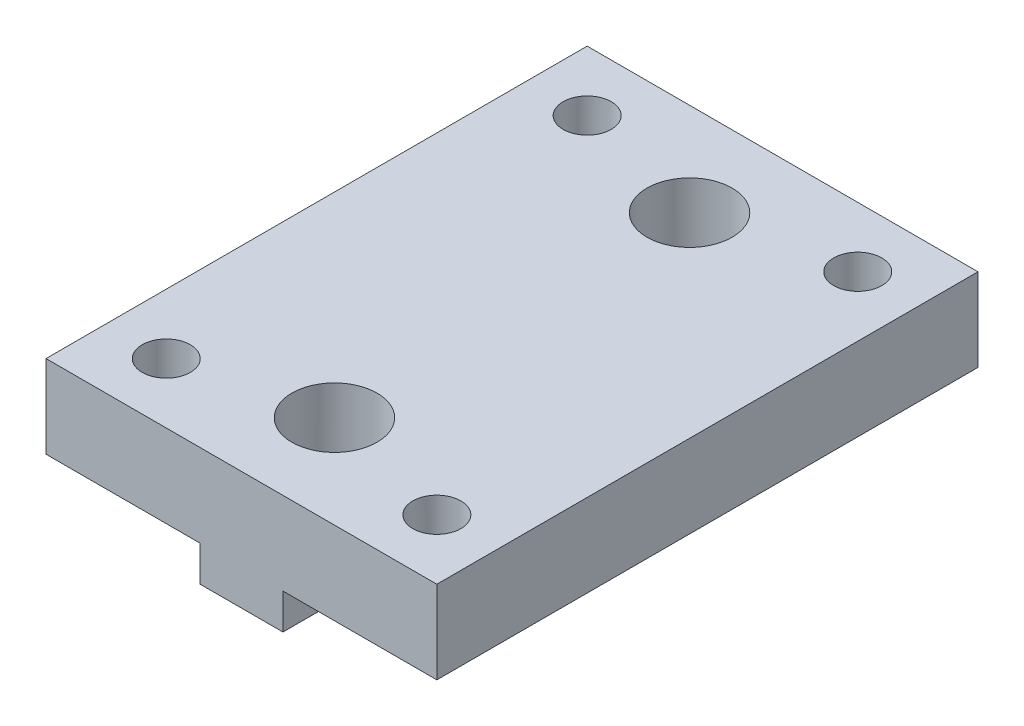
ISO-10303-21;
HEADER;
FILE_DESCRIPTION(('STEP AP214'),'2;1');
FILE_NAME('part.step','',(''),(''),'','','');
FILE_SCHEMA(('AUTOMOTIVE_DESIGN { 1 0 10303 214 1 1 1 1 }'));
ENDSEC;
DATA;
#1=APPLICATION_CONTEXT('core data for automotive mechanical design processes');
#2=APPLICATION_PROTOCOL_DEFINITION('international standard','automotive_design',2000,#1);
#3=PRODUCT_CONTEXT('',#1,'mechanical');
#4=PRODUCT('Part','Part','',(#3));
#5=PRODUCT_RELATED_PRODUCT_CATEGORY('part','',(#4));
#6=PRODUCT_DEFINITION_FORMATION('','',#4);
#7=PRODUCT_DEFINITION_CONTEXT('part definition',#1,'design');
#8=PRODUCT_DEFINITION('design','',#6,#7);
#9=PRODUCT_DEFINITION_SHAPE('','',#8);
#10=(LENGTH_UNIT() NAMED_UNIT(*) SI_UNIT(.MILLI.,.METRE.));
#11=(NAMED_UNIT(*) PLANE_ANGLE_UNIT() SI_UNIT($,.RADIAN.));
#12=(NAMED_UNIT(*) SI_UNIT($,.STERADIAN.) SOLID_ANGLE_UNIT());
#13=UNCERTAINTY_MEASURE_WITH_UNIT(LENGTH_MEASURE(1.E-05),#10,'distance_accuracy_value','');
#14=(GEOMETRIC_REPRESENTATION_CONTEXT(3) GLOBAL_UNCERTAINTY_ASSIGNED_CONTEXT((#13)) GLOBAL_UNIT_ASSIGNED_CONTEXT((#10,
#11,#12)) REPRESENTATION_CONTEXT('',''));
#15=CARTESIAN_POINT('',(0.,0.,0.));
#16=DIRECTION('',(0.,0.,1.));
#17=DIRECTION('',(1.,0.,0.));
#18=AXIS2_PLACEMENT_3D('',#15,#16,#17);
#19=CARTESIAN_POINT('',(0.,0.,0.));
#20=DIRECTION('',(0.,1.,0.));
#21=DIRECTION('',(0.,0.,1.));
#22=AXIS2_PLACEMENT_3D('',#19,#20,#21);
#23=PLANE('',#22);
#24=DIRECTION('',(-1.,0.,0.));
#25=VECTOR('',#24,1.);
#26=CARTESIAN_POINT('',(-16.51,0.,-22.86));
#27=LINE('',#26,#25);
#28=CARTESIAN_POINT('',(3.51,0.,-22.86));
#29=VERTEX_POINT('',#28);
#30=CARTESIAN_POINT('',(-3.51,0.,-22.86));
#31=VERTEX_POINT('',#30);
#32=EDGE_CURVE('E208',#29,#31,#27,.T.);
#33=ORIENTED_EDGE('',*,*,#32,.F.);
#34=DIRECTION('',(0.,0.,-1.));
#35=VECTOR('',#34,1.);
#36=CARTESIAN_POINT('',(3.51,0.,-22.86));
#37=LINE('',#36,#35);
#38=CARTESIAN_POINT('',(3.51,0.,-15.7999374975584));
#39=VERTEX_POINT('',#38);
#40=EDGE_CURVE('E202',#39,#29,#37,.T.);
#41=ORIENTED_EDGE('',*,*,#40,.F.);
#42=CARTESIAN_POINT('',(0.,0.,-15.));
#43=DIRECTION('',(0.,1.,0.));
#44=DIRECTION('',(0.,0.,1.));
#45=AXIS2_PLACEMENT_3D('',#42,#43,#44);
#46=CIRCLE('',#45,3.6);
#47=CARTESIAN_POINT('',(-3.51,0.,-15.7999374975584));
#48=VERTEX_POINT('',#47);
#49=EDGE_CURVE('E196',#39,#48,#46,.T.);
#50=ORIENTED_EDGE('',*,*,#49,.T.);
#51=DIRECTION('',(0.,0.,1.));
#52=VECTOR('',#51,1.);
#53=CARTESIAN_POINT('',(-3.51,0.,-22.86));
#54=LINE('',#53,#52);
#55=EDGE_CURVE('E288',#31,#48,#54,.T.);
#56=ORIENTED_EDGE('',*,*,#55,.F.);
#57=EDGE_LOOP('',(#33,#41,#50,#56));
#58=FACE_BOUND('',#57,.T.);
#59=ADVANCED_FACE('F33',(#58),#23,.F.);
#60=CARTESIAN_POINT('',(-3.51,0.,-14.2000625024416));
#61=VERTEX_POINT('',#60);
#62=CARTESIAN_POINT('',(3.51,0.,-14.2000625024416));
#63=VERTEX_POINT('',#62);
#64=EDGE_CURVE('E319',#61,#63,#46,.T.);
#65=ORIENTED_EDGE('',*,*,#64,.T.);
#66=CARTESIAN_POINT('',(3.51,0.,14.2000625024416));
#67=VERTEX_POINT('',#66);
#68=EDGE_CURVE('E209',#67,#63,#37,.T.);
#69=ORIENTED_EDGE('',*,*,#68,.F.);
#70=CARTESIAN_POINT('',(0.,0.,15.));
#71=DIRECTION('',(0.,1.,0.));
#72=DIRECTION('',(0.,0.,1.));
#73=AXIS2_PLACEMENT_3D('',#70,#71,#72);
#74=CIRCLE('',#73,3.6);
#75=CARTESIAN_POINT('',(-3.51,0.,14.2000625024416));
#76=VERTEX_POINT('',#75);
#77=EDGE_CURVE('E240',#67,#76,#74,.T.);
#78=ORIENTED_EDGE('',*,*,#77,.T.);
#79=EDGE_CURVE('E294',#61,#76,#54,.T.);
#80=ORIENTED_EDGE('',*,*,#79,.F.);
#81=EDGE_LOOP('',(#65,#69,#78,#80));
#82=FACE_BOUND('',#81,.T.);
#83=ADVANCED_FACE('F360',(#82),#23,.F.);
#84=CARTESIAN_POINT('',(16.51,10.,-22.86));
#85=DIRECTION('',(-1.,0.,0.));
#86=DIRECTION('',(0.,0.,1.));
#87=AXIS2_PLACEMENT_3D('',#84,#85,#86);
#88=PLANE('',#87);
#89=DIRECTION('',(0.,0.,1.));
#90=VECTOR('',#89,1.);
#91=CARTESIAN_POINT('',(16.51,3.,-22.86));
#92=LINE('',#91,#90);
#93=CARTESIAN_POINT('',(16.51,3.,-22.86));
#94=VERTEX_POINT('',#93);
#95=CARTESIAN_POINT('',(16.51,3.,22.86));
#96=VERTEX_POINT('',#95);
#97=EDGE_CURVE('E145',#94,#96,#92,.T.);
#98=ORIENTED_EDGE('',*,*,#97,.F.);
#99=DIRECTION('',(0.,-1.,0.));
#100=VECTOR('',#99,1.);
#101=CARTESIAN_POINT('',(16.51,10.,-22.86));
#102=LINE('',#101,#100);
#103=CARTESIAN_POINT('',(16.51,10.,-22.86));
#104=VERTEX_POINT('',#103);
#105=EDGE_CURVE('E171',#104,#94,#102,.T.);
#106=ORIENTED_EDGE('',*,*,#105,.F.);
#107=DIRECTION('',(0.,0.,-1.));
#108=VECTOR('',#107,1.);
#109=CARTESIAN_POINT('',(16.51,10.,-22.86));
#110=LINE('',#109,#108);
#111=CARTESIAN_POINT('',(16.51,10.,22.86));
#112=VERTEX_POINT('',#111);
#113=EDGE_CURVE('E169',#112,#104,#110,.T.);
#114=ORIENTED_EDGE('',*,*,#113,.F.);
#115=DIRECTION('',(0.,-1.,0.));
#116=VECTOR('',#115,1.);
#117=CARTESIAN_POINT('',(16.51,10.,22.86));
#118=LINE('',#117,#116);
#119=EDGE_CURVE('E163',#112,#96,#118,.T.);
#120=ORIENTED_EDGE('',*,*,#119,.T.);
#121=EDGE_LOOP('',(#98,#106,#114,#120));
#122=FACE_BOUND('',#121,.T.);
#123=ADVANCED_FACE('F168',(#122),#88,.F.);
#124=CARTESIAN_POINT('',(11.43,10.,-17.78));
#125=DIRECTION('',(0.,-1.,0.));
#126=DIRECTION('',(0.,0.,-1.));
#127=AXIS2_PLACEMENT_3D('',#124,#125,#126);
#128=CYLINDRICAL_SURFACE('',#127,2.032);
#129=CARTESIAN_POINT('',(11.43,10.,-17.78));
#130=DIRECTION('',(0.,1.,0.));
#131=DIRECTION('',(0.,0.,1.));
#132=AXIS2_PLACEMENT_3D('',#129,#130,#131);
#133=CIRCLE('',#132,2.032);
#134=CARTESIAN_POINT('',(11.43,10.,-15.748));
#135=VERTEX_POINT('',#134);
#136=EDGE_CURVE('E255',#135,#135,#133,.T.);
#137=ORIENTED_EDGE('',*,*,#136,.T.);
#138=EDGE_LOOP('',(#137));
#139=FACE_BOUND('',#138,.T.);
#140=CARTESIAN_POINT('',(11.43,3.,-17.78));
#141=DIRECTION('',(0.,-1.,0.));
#142=DIRECTION('',(0.,0.,-1.));
#143=AXIS2_PLACEMENT_3D('',#140,#141,#142);
#144=CIRCLE('',#143,2.032);
#145=CARTESIAN_POINT('',(11.43,3.,-19.812));
#146=VERTEX_POINT('',#145);
#147=EDGE_CURVE('E316',#146,#146,#144,.T.);
#148=ORIENTED_EDGE('',*,*,#147,.T.);
#149=EDGE_LOOP('',(#148));
#150=FACE_BOUND('',#149,.T.);
#151=ADVANCED_FACE('F346',(#139,#150),#128,.F.);
#152=CARTESIAN_POINT('',(11.43,10.,17.78));
#153=DIRECTION('',(0.,-1.,0.));
#154=DIRECTION('',(0.,0.,-1.));
#155=AXIS2_PLACEMENT_3D('',#152,#153,#154);
#156=CYLINDRICAL_SURFACE('',#155,2.032);
#157=CARTESIAN_POINT('',(11.43,10.,17.78));
#158=DIRECTION('',(0.,1.,0.));
#159=DIRECTION('',(0.,0.,1.));
#160=AXIS2_PLACEMENT_3D('',#157,#158,#159);
#161=CIRCLE('',#160,2.032);
#162=CARTESIAN_POINT('',(11.43,10.,19.812));
#163=VERTEX_POINT('',#162);
#164=EDGE_CURVE('E249',#163,#163,#161,.T.);
#165=ORIENTED_EDGE('',*,*,#164,.T.);
#166=EDGE_LOOP('',(#165));
#167=FACE_BOUND('',#166,.T.);
#168=CARTESIAN_POINT('',(11.43,3.,17.78));
#169=DIRECTION('',(0.,-1.,0.));
#170=DIRECTION('',(0.,0.,-1.));
#171=AXIS2_PLACEMENT_3D('',#168,#169,#170);
#172=CIRCLE('',#171,2.032);
#173=CARTESIAN_POINT('',(11.43,3.,15.748));
#174=VERTEX_POINT('',#173);
#175=EDGE_CURVE('E313',#174,#174,#172,.T.);
#176=ORIENTED_EDGE('',*,*,#175,.T.);
#177=EDGE_LOOP('',(#176));
#178=FACE_BOUND('',#177,.T.);
#179=ADVANCED_FACE('F331',(#167,#178),#156,.F.);
#180=CARTESIAN_POINT('',(0.,10.,0.));
#181=DIRECTION('',(0.,1.,0.));
#182=DIRECTION('',(0.,0.,1.));
#183=AXIS2_PLACEMENT_3D('',#180,#181,#182);
#184=PLANE('',#183);
#185=CARTESIAN_POINT('',(0.,10.,-15.));
#186=DIRECTION('',(0.,1.,0.));
#187=DIRECTION('',(0.,0.,1.));
#188=AXIS2_PLACEMENT_3D('',#185,#186,#187);
#189=CIRCLE('',#188,3.6);
#190=CARTESIAN_POINT('',(0.,10.,-11.4));
#191=VERTEX_POINT('',#190);
#192=EDGE_CURVE('E243',#191,#191,#189,.T.);
#193=ORIENTED_EDGE('',*,*,#192,.F.);
#194=EDGE_LOOP('',(#193));
#195=FACE_BOUND('',#194,.T.);
#196=CARTESIAN_POINT('',(0.,10.,15.));
#197=DIRECTION('',(0.,1.,0.));
#198=DIRECTION('',(0.,0.,1.));
#199=AXIS2_PLACEMENT_3D('',#196,#197,#198);
#200=CIRCLE('',#199,3.6);
#201=CARTESIAN_POINT('',(0.,10.,18.6));
#202=VERTEX_POINT('',#201);
#203=EDGE_CURVE('E234',#202,#202,#200,.T.);
#204=ORIENTED_EDGE('',*,*,#203,.F.);
#205=EDGE_LOOP('',(#204));
#206=FACE_BOUND('',#205,.T.);
#207=CARTESIAN_POINT('',(-11.43,10.,17.78));
#208=DIRECTION('',(0.,1.,0.));
#209=DIRECTION('',(0.,0.,1.));
#210=AXIS2_PLACEMENT_3D('',#207,#208,#209);
#211=CIRCLE('',#210,2.032);
#212=CARTESIAN_POINT('',(-11.43,10.,19.812));
#213=VERTEX_POINT('',#212);
#214=EDGE_CURVE('E252',#213,#213,#211,.T.);
#215=ORIENTED_EDGE('',*,*,#214,.F.);
#216=EDGE_LOOP('',(#215));
#217=FACE_BOUND('',#216,.T.);
#218=CARTESIAN_POINT('',(-11.43,10.,-17.78));
#219=DIRECTION('',(0.,1.,0.));
#220=DIRECTION('',(0.,0.,1.));
#221=AXIS2_PLACEMENT_3D('',#218,#219,#220);
#222=CIRCLE('',#221,2.032);
#223=CARTESIAN_POINT('',(-11.43,10.,-15.748));
#224=VERTEX_POINT('',#223);
#225=EDGE_CURVE('E258',#224,#224,#222,.T.);
#226=ORIENTED_EDGE('',*,*,#225,.F.);
#227=EDGE_LOOP('',(#226));
#228=FACE_BOUND('',#227,.T.);
#229=DIRECTION('',(0.,0.,1.));
#230=VECTOR('',#229,1.);
#231=CARTESIAN_POINT('',(-16.51,10.,-22.86));
#232=LINE('',#231,#230);
#233=CARTESIAN_POINT('',(-16.51,10.,-22.86));
#234=VERTEX_POINT('',#233);
#235=CARTESIAN_POINT('',(-16.51,10.,22.86));
#236=VERTEX_POINT('',#235);
#237=EDGE_CURVE('E262',#234,#236,#232,.T.);
#238=ORIENTED_EDGE('',*,*,#237,.T.);
#239=DIRECTION('',(1.,0.,0.));
#240=VECTOR('',#239,1.);
#241=CARTESIAN_POINT('',(-16.51,10.,22.86));
#242=LINE('',#241,#240);
#243=EDGE_CURVE('E265',#236,#112,#242,.T.);
#244=ORIENTED_EDGE('',*,*,#243,.T.);
#245=ORIENTED_EDGE('',*,*,#113,.T.);
#246=DIRECTION('',(-1.,0.,0.));
#247=VECTOR('',#246,1.);
#248=CARTESIAN_POINT('',(-16.51,10.,-22.86));
#249=LINE('',#248,#247);
#250=EDGE_CURVE('E268',#104,#234,#249,.T.);
#251=ORIENTED_EDGE('',*,*,#250,.T.);
#252=EDGE_LOOP('',(#238,#244,#245,#251));
#253=FACE_BOUND('',#252,.T.);
#254=ORIENTED_EDGE('',*,*,#136,.F.);
#255=EDGE_LOOP('',(#254));
#256=FACE_BOUND('',#255,.T.);
#257=ORIENTED_EDGE('',*,*,#164,.F.);
#258=EDGE_LOOP('',(#257));
#259=FACE_BOUND('',#258,.T.);
#260=ADVANCED_FACE('F328',(#195,#206,#217,#228,#253,#256,#259),#184,.T.);
#261=CARTESIAN_POINT('',(-3.51,0.,15.7999374975584));
#262=VERTEX_POINT('',#261);
#263=CARTESIAN_POINT('',(3.51,0.,15.7999374975584));
#264=VERTEX_POINT('',#263);
#265=EDGE_CURVE('E231',#262,#264,#74,.T.);
#266=ORIENTED_EDGE('',*,*,#265,.T.);
#267=CARTESIAN_POINT('',(3.51,0.,22.86));
#268=VERTEX_POINT('',#267);
#269=EDGE_CURVE('E157',#268,#264,#37,.T.);
#270=ORIENTED_EDGE('',*,*,#269,.F.);
#271=DIRECTION('',(1.,0.,0.));
#272=VECTOR('',#271,1.);
#273=CARTESIAN_POINT('',(-16.51,0.,22.86));
#274=LINE('',#273,#272);
#275=CARTESIAN_POINT('',(-3.51,0.,22.86));
#276=VERTEX_POINT('',#275);
#277=EDGE_CURVE('E261',#276,#268,#274,.T.);
#278=ORIENTED_EDGE('',*,*,#277,.F.);
#279=EDGE_CURVE('E239',#262,#276,#54,.T.);
#280=ORIENTED_EDGE('',*,*,#279,.F.);
#281=EDGE_LOOP('',(#266,#270,#278,#280));
#282=FACE_BOUND('',#281,.T.);
#283=ADVANCED_FACE('F238',(#282),#23,.F.);
#284=CARTESIAN_POINT('',(-16.51,10.,-22.86));
#285=DIRECTION('',(1.,0.,0.));
#286=DIRECTION('',(0.,0.,-1.));
#287=AXIS2_PLACEMENT_3D('',#284,#285,#286);
#288=PLANE('',#287);
#289=DIRECTION('',(0.,-1.,0.));
#290=VECTOR('',#289,1.);
#291=CARTESIAN_POINT('',(-16.51,10.,-22.86));
#292=LINE('',#291,#290);
#293=CARTESIAN_POINT('',(-16.51,3.,-22.86));
#294=VERTEX_POINT('',#293);
#295=EDGE_CURVE('E176',#234,#294,#292,.T.);
#296=ORIENTED_EDGE('',*,*,#295,.T.);
#297=DIRECTION('',(0.,0.,-1.));
#298=VECTOR('',#297,1.);
#299=CARTESIAN_POINT('',(-16.51,3.,-22.86));
#300=LINE('',#299,#298);
#301=CARTESIAN_POINT('',(-16.51,3.,22.86));
#302=VERTEX_POINT('',#301);
#303=EDGE_CURVE('E277',#302,#294,#300,.T.);
#304=ORIENTED_EDGE('',*,*,#303,.F.);
#305=DIRECTION('',(0.,-1.,0.));
#306=VECTOR('',#305,1.);
#307=CARTESIAN_POINT('',(-16.51,10.,22.86));
#308=LINE('',#307,#306);
#309=EDGE_CURVE('E170',#236,#302,#308,.T.);
#310=ORIENTED_EDGE('',*,*,#309,.F.);
#311=ORIENTED_EDGE('',*,*,#237,.F.);
#312=EDGE_LOOP('',(#296,#304,#310,#311));
#313=FACE_BOUND('',#312,.T.);
#314=ADVANCED_FACE('F35',(#313),#288,.F.);
#315=CARTESIAN_POINT('',(-16.51,10.,22.86));
#316=DIRECTION('',(0.,0.,-1.));
#317=DIRECTION('',(-1.,0.,0.));
#318=AXIS2_PLACEMENT_3D('',#315,#316,#317);
#319=PLANE('',#318);
#320=ORIENTED_EDGE('',*,*,#277,.T.);
#321=DIRECTION('',(0.,-1.,0.));
#322=VECTOR('',#321,1.);
#323=CARTESIAN_POINT('',(3.51,3.,22.86));
#324=LINE('',#323,#322);
#325=CARTESIAN_POINT('',(3.51,3.,22.86));
#326=VERTEX_POINT('',#325);
#327=EDGE_CURVE('E165',#326,#268,#324,.T.);
#328=ORIENTED_EDGE('',*,*,#327,.F.);
#329=DIRECTION('',(-1.,0.,0.));
#330=VECTOR('',#329,1.);
#331=CARTESIAN_POINT('',(16.51,3.,22.86));
#332=LINE('',#331,#330);
#333=EDGE_CURVE('E149',#96,#326,#332,.T.);
#334=ORIENTED_EDGE('',*,*,#333,.F.);
#335=ORIENTED_EDGE('',*,*,#119,.F.);
#336=ORIENTED_EDGE('',*,*,#243,.F.);
#337=ORIENTED_EDGE('',*,*,#309,.T.);
#338=DIRECTION('',(-1.,0.,0.));
#339=VECTOR('',#338,1.);
#340=CARTESIAN_POINT('',(-16.51,3.,22.86));
#341=LINE('',#340,#339);
#342=CARTESIAN_POINT('',(-3.51,3.,22.86));
#343=VERTEX_POINT('',#342);
#344=EDGE_CURVE('E292',#343,#302,#341,.T.);
#345=ORIENTED_EDGE('',*,*,#344,.F.);
#346=DIRECTION('',(0.,-1.,0.));
#347=VECTOR('',#346,1.);
#348=CARTESIAN_POINT('',(-3.51,3.,22.86));
#349=LINE('',#348,#347);
#350=EDGE_CURVE('E210',#343,#276,#349,.T.);
#351=ORIENTED_EDGE('',*,*,#350,.T.);
#352=EDGE_LOOP('',(#320,#328,#334,#335,#336,#337,#345,#351));
#353=FACE_BOUND('',#352,.T.);
#354=ADVANCED_FACE('F162',(#353),#319,.F.);
#355=CARTESIAN_POINT('',(-16.51,10.,-22.86));
#356=DIRECTION('',(0.,0.,1.));
#357=DIRECTION('',(1.,0.,0.));
#358=AXIS2_PLACEMENT_3D('',#355,#356,#357);
#359=PLANE('',#358);
#360=DIRECTION('',(1.,0.,0.));
#361=VECTOR('',#360,1.);
#362=CARTESIAN_POINT('',(16.51,3.,-22.86));
#363=LINE('',#362,#361);
#364=CARTESIAN_POINT('',(3.51,3.,-22.86));
#365=VERTEX_POINT('',#364);
#366=EDGE_CURVE('E152',#365,#94,#363,.T.);
#367=ORIENTED_EDGE('',*,*,#366,.F.);
#368=DIRECTION('',(0.,-1.,0.));
#369=VECTOR('',#368,1.);
#370=CARTESIAN_POINT('',(3.51,3.,-22.86));
#371=LINE('',#370,#369);
#372=EDGE_CURVE('E301',#365,#29,#371,.T.);
#373=ORIENTED_EDGE('',*,*,#372,.T.);
#374=ORIENTED_EDGE('',*,*,#32,.T.);
#375=DIRECTION('',(0.,-1.,0.));
#376=VECTOR('',#375,1.);
#377=CARTESIAN_POINT('',(-3.51,3.,-22.86));
#378=LINE('',#377,#376);
#379=CARTESIAN_POINT('',(-3.51,3.,-22.86));
#380=VERTEX_POINT('',#379);
#381=EDGE_CURVE('E213',#380,#31,#378,.T.);
#382=ORIENTED_EDGE('',*,*,#381,.F.);
#383=DIRECTION('',(1.,0.,0.));
#384=VECTOR('',#383,1.);
#385=CARTESIAN_POINT('',(-16.51,3.,-22.86));
#386=LINE('',#385,#384);
#387=EDGE_CURVE('E283',#294,#380,#386,.T.);
#388=ORIENTED_EDGE('',*,*,#387,.F.);
#389=ORIENTED_EDGE('',*,*,#295,.F.);
#390=ORIENTED_EDGE('',*,*,#250,.F.);
#391=ORIENTED_EDGE('',*,*,#105,.T.);
#392=EDGE_LOOP('',(#367,#373,#374,#382,#388,#389,#390,#391));
#393=FACE_BOUND('',#392,.T.);
#394=ADVANCED_FACE('F281',(#393),#359,.F.);
#395=CARTESIAN_POINT('',(-11.43,10.,-17.78));
#396=DIRECTION('',(0.,-1.,0.));
#397=DIRECTION('',(0.,0.,-1.));
#398=AXIS2_PLACEMENT_3D('',#395,#396,#397);
#399=CYLINDRICAL_SURFACE('',#398,2.032);
#400=CARTESIAN_POINT('',(-11.43,3.,-17.78));
#401=DIRECTION('',(0.,1.,0.));
#402=DIRECTION('',(0.,0.,1.));
#403=AXIS2_PLACEMENT_3D('',#400,#401,#402);
#404=CIRCLE('',#403,2.032);
#405=CARTESIAN_POINT('',(-11.43,3.,-15.748));
#406=VERTEX_POINT('',#405);
#407=EDGE_CURVE('E304',#406,#406,#404,.T.);
#408=ORIENTED_EDGE('',*,*,#407,.F.);
#409=EDGE_LOOP('',(#408));
#410=FACE_BOUND('',#409,.T.);
#411=ORIENTED_EDGE('',*,*,#225,.T.);
#412=EDGE_LOOP('',(#411));
#413=FACE_BOUND('',#412,.T.);
#414=ADVANCED_FACE('F376',(#410,#413),#399,.F.);
#415=CARTESIAN_POINT('',(-11.43,10.,17.78));
#416=DIRECTION('',(0.,-1.,0.));
#417=DIRECTION('',(0.,0.,-1.));
#418=AXIS2_PLACEMENT_3D('',#415,#416,#417);
#419=CYLINDRICAL_SURFACE('',#418,2.032);
#420=CARTESIAN_POINT('',(-11.43,3.,17.78));
#421=DIRECTION('',(0.,1.,0.));
#422=DIRECTION('',(0.,0.,1.));
#423=AXIS2_PLACEMENT_3D('',#420,#421,#422);
#424=CIRCLE('',#423,2.032);
#425=CARTESIAN_POINT('',(-11.43,3.,19.812));
#426=VERTEX_POINT('',#425);
#427=EDGE_CURVE('E300',#426,#426,#424,.T.);
#428=ORIENTED_EDGE('',*,*,#427,.F.);
#429=EDGE_LOOP('',(#428));
#430=FACE_BOUND('',#429,.T.);
#431=ORIENTED_EDGE('',*,*,#214,.T.);
#432=EDGE_LOOP('',(#431));
#433=FACE_BOUND('',#432,.T.);
#434=ADVANCED_FACE('F389',(#430,#433),#419,.F.);
#435=CARTESIAN_POINT('',(0.,0.,15.));
#436=DIRECTION('',(0.,1.,0.));
#437=DIRECTION('',(0.,0.,1.));
#438=AXIS2_PLACEMENT_3D('',#435,#436,#437);
#439=CYLINDRICAL_SURFACE('',#438,3.6);
#440=CARTESIAN_POINT('',(0.,3.,15.));
#441=DIRECTION('',(0.,-1.,0.));
#442=DIRECTION('',(0.,0.,-1.));
#443=AXIS2_PLACEMENT_3D('',#440,#441,#442);
#444=CIRCLE('',#443,3.6);
#445=CARTESIAN_POINT('',(3.51,3.,15.7999374975584));
#446=VERTEX_POINT('',#445);
#447=CARTESIAN_POINT('',(3.51,3.,14.2000625024416));
#448=VERTEX_POINT('',#447);
#449=EDGE_CURVE('E233',#446,#448,#444,.F.);
#450=ORIENTED_EDGE('',*,*,#449,.F.);
#451=DIRECTION('',(0.,1.,0.));
#452=VECTOR('',#451,1.);
#453=CARTESIAN_POINT('',(3.51,0.,15.7999374975584));
#454=LINE('',#453,#452);
#455=EDGE_CURVE('E221',#446,#264,#454,.F.);
#456=ORIENTED_EDGE('',*,*,#455,.T.);
#457=ORIENTED_EDGE('',*,*,#265,.F.);
#458=DIRECTION('',(0.,1.,0.));
#459=VECTOR('',#458,1.);
#460=CARTESIAN_POINT('',(-3.51,0.,15.7999374975584));
#461=LINE('',#460,#459);
#462=CARTESIAN_POINT('',(-3.51,3.,15.7999374975584));
#463=VERTEX_POINT('',#462);
#464=EDGE_CURVE('E307',#262,#463,#461,.T.);
#465=ORIENTED_EDGE('',*,*,#464,.T.);
#466=CARTESIAN_POINT('',(0.,3.,15.));
#467=DIRECTION('',(0.,1.,0.));
#468=DIRECTION('',(0.,0.,1.));
#469=AXIS2_PLACEMENT_3D('',#466,#467,#468);
#470=CIRCLE('',#469,3.6);
#471=CARTESIAN_POINT('',(-3.51,3.,14.2000625024416));
#472=VERTEX_POINT('',#471);
#473=EDGE_CURVE('E297',#463,#472,#470,.F.);
#474=ORIENTED_EDGE('',*,*,#473,.T.);
#475=DIRECTION('',(0.,1.,0.));
#476=VECTOR('',#475,1.);
#477=CARTESIAN_POINT('',(-3.51,0.,14.2000625024416));
#478=LINE('',#477,#476);
#479=EDGE_CURVE('E309',#472,#76,#478,.F.);
#480=ORIENTED_EDGE('',*,*,#479,.T.);
#481=ORIENTED_EDGE('',*,*,#77,.F.);
#482=DIRECTION('',(0.,1.,0.));
#483=VECTOR('',#482,1.);
#484=CARTESIAN_POINT('',(3.51,0.,14.2000625024416));
#485=LINE('',#484,#483);
#486=EDGE_CURVE('E235',#67,#448,#485,.T.);
#487=ORIENTED_EDGE('',*,*,#486,.T.);
#488=EDGE_LOOP('',(#450,#456,#457,#465,#474,#480,#481,#487));
#489=FACE_BOUND('',#488,.T.);
#490=ORIENTED_EDGE('',*,*,#203,.T.);
#491=EDGE_LOOP('',(#490));
#492=FACE_BOUND('',#491,.T.);
#493=ADVANCED_FACE('F228',(#489,#492),#439,.F.);
#494=CARTESIAN_POINT('',(0.,0.,-15.));
#495=DIRECTION('',(0.,1.,0.));
#496=DIRECTION('',(0.,0.,1.));
#497=AXIS2_PLACEMENT_3D('',#494,#495,#496);
#498=CYLINDRICAL_SURFACE('',#497,3.6);
#499=CARTESIAN_POINT('',(0.,3.,-15.));
#500=DIRECTION('',(0.,-1.,0.));
#501=DIRECTION('',(0.,0.,-1.));
#502=AXIS2_PLACEMENT_3D('',#499,#500,#501);
#503=CIRCLE('',#502,3.6);
#504=CARTESIAN_POINT('',(3.51,3.,-14.2000625024416));
#505=VERTEX_POINT('',#504);
#506=CARTESIAN_POINT('',(3.51,3.,-15.7999374975584));
#507=VERTEX_POINT('',#506);
#508=EDGE_CURVE('E188',#505,#507,#503,.F.);
#509=ORIENTED_EDGE('',*,*,#508,.F.);
#510=DIRECTION('',(0.,1.,0.));
#511=VECTOR('',#510,1.);
#512=CARTESIAN_POINT('',(3.51,0.,-14.2000625024416));
#513=LINE('',#512,#511);
#514=EDGE_CURVE('E11',#505,#63,#513,.F.);
#515=ORIENTED_EDGE('',*,*,#514,.T.);
#516=ORIENTED_EDGE('',*,*,#64,.F.);
#517=DIRECTION('',(0.,1.,0.));
#518=VECTOR('',#517,1.);
#519=CARTESIAN_POINT('',(-3.51,0.,-14.2000625024416));
#520=LINE('',#519,#518);
#521=CARTESIAN_POINT('',(-3.51,3.,-14.2000625024416));
#522=VERTEX_POINT('',#521);
#523=EDGE_CURVE('E182',#61,#522,#520,.T.);
#524=ORIENTED_EDGE('',*,*,#523,.T.);
#525=CARTESIAN_POINT('',(0.,3.,-15.));
#526=DIRECTION('',(0.,1.,0.));
#527=DIRECTION('',(0.,0.,1.));
#528=AXIS2_PLACEMENT_3D('',#525,#526,#527);
#529=CIRCLE('',#528,3.6);
#530=CARTESIAN_POINT('',(-3.51,3.,-15.7999374975584));
#531=VERTEX_POINT('',#530);
#532=EDGE_CURVE('E174',#522,#531,#529,.F.);
#533=ORIENTED_EDGE('',*,*,#532,.T.);
#534=DIRECTION('',(0.,1.,0.));
#535=VECTOR('',#534,1.);
#536=CARTESIAN_POINT('',(-3.51,0.,-15.7999374975584));
#537=LINE('',#536,#535);
#538=EDGE_CURVE('E185',#531,#48,#537,.F.);
#539=ORIENTED_EDGE('',*,*,#538,.T.);
#540=ORIENTED_EDGE('',*,*,#49,.F.);
#541=DIRECTION('',(0.,1.,0.));
#542=VECTOR('',#541,1.);
#543=CARTESIAN_POINT('',(3.51,0.,-15.7999374975584));
#544=LINE('',#543,#542);
#545=EDGE_CURVE('E41',#39,#507,#544,.T.);
#546=ORIENTED_EDGE('',*,*,#545,.T.);
#547=EDGE_LOOP('',(#509,#515,#516,#524,#533,#539,#540,#546));
#548=FACE_BOUND('',#547,.T.);
#549=ORIENTED_EDGE('',*,*,#192,.T.);
#550=EDGE_LOOP('',(#549));
#551=FACE_BOUND('',#550,.T.);
#552=ADVANCED_FACE('F193',(#548,#551),#498,.F.);
#553=CARTESIAN_POINT('',(-3.51,3.,-22.86));
#554=DIRECTION('',(1.,0.,0.));
#555=DIRECTION('',(0.,0.,-1.));
#556=AXIS2_PLACEMENT_3D('',#553,#554,#555);
#557=PLANE('',#556);
#558=DIRECTION('',(0.,0.,1.));
#559=VECTOR('',#558,1.);
#560=CARTESIAN_POINT('',(-3.51,3.,-22.86));
#561=LINE('',#560,#559);
#562=EDGE_CURVE('E286',#522,#472,#561,.T.);
#563=ORIENTED_EDGE('',*,*,#562,.F.);
#564=ORIENTED_EDGE('',*,*,#523,.F.);
#565=ORIENTED_EDGE('',*,*,#79,.T.);
#566=ORIENTED_EDGE('',*,*,#479,.F.);
#567=EDGE_LOOP('',(#563,#564,#565,#566));
#568=FACE_BOUND('',#567,.T.);
#569=ADVANCED_FACE('F417',(#568),#557,.F.);
#570=ORIENTED_EDGE('',*,*,#279,.T.);
#571=ORIENTED_EDGE('',*,*,#350,.F.);
#572=EDGE_CURVE('E284',#463,#343,#561,.T.);
#573=ORIENTED_EDGE('',*,*,#572,.F.);
#574=ORIENTED_EDGE('',*,*,#464,.F.);
#575=EDGE_LOOP('',(#570,#571,#573,#574));
#576=FACE_BOUND('',#575,.T.);
#577=ADVANCED_FACE('F410',(#576),#557,.F.);
#578=EDGE_CURVE('E56',#380,#531,#561,.T.);
#579=ORIENTED_EDGE('',*,*,#578,.F.);
#580=ORIENTED_EDGE('',*,*,#381,.T.);
#581=ORIENTED_EDGE('',*,*,#55,.T.);
#582=ORIENTED_EDGE('',*,*,#538,.F.);
#583=EDGE_LOOP('',(#579,#580,#581,#582));
#584=FACE_BOUND('',#583,.T.);
#585=ADVANCED_FACE('F402',(#584),#557,.F.);
#586=CARTESIAN_POINT('',(0.,3.,0.));
#587=DIRECTION('',(0.,1.,0.));
#588=DIRECTION('',(0.,0.,1.));
#589=AXIS2_PLACEMENT_3D('',#586,#587,#588);
#590=PLANE('',#589);
#591=ORIENTED_EDGE('',*,*,#407,.T.);
#592=EDGE_LOOP('',(#591));
#593=FACE_BOUND('',#592,.T.);
#594=ORIENTED_EDGE('',*,*,#427,.T.);
#595=EDGE_LOOP('',(#594));
#596=FACE_BOUND('',#595,.T.);
#597=ORIENTED_EDGE('',*,*,#572,.T.);
#598=ORIENTED_EDGE('',*,*,#344,.T.);
#599=ORIENTED_EDGE('',*,*,#303,.T.);
#600=ORIENTED_EDGE('',*,*,#387,.T.);
#601=ORIENTED_EDGE('',*,*,#578,.T.);
#602=ORIENTED_EDGE('',*,*,#532,.F.);
#603=ORIENTED_EDGE('',*,*,#562,.T.);
#604=ORIENTED_EDGE('',*,*,#473,.F.);
#605=EDGE_LOOP('',(#597,#598,#599,#600,#601,#602,#603,#604));
#606=FACE_BOUND('',#605,.T.);
#607=ADVANCED_FACE('F399',(#593,#596,#606),#590,.F.);
#608=CARTESIAN_POINT('',(3.51,3.,-22.86));
#609=DIRECTION('',(-1.,0.,0.));
#610=DIRECTION('',(0.,0.,1.));
#611=AXIS2_PLACEMENT_3D('',#608,#609,#610);
#612=PLANE('',#611);
#613=DIRECTION('',(0.,0.,-1.));
#614=VECTOR('',#613,1.);
#615=CARTESIAN_POINT('',(3.51,3.,-22.86));
#616=LINE('',#615,#614);
#617=EDGE_CURVE('E411',#326,#446,#616,.T.);
#618=ORIENTED_EDGE('',*,*,#617,.F.);
#619=ORIENTED_EDGE('',*,*,#327,.T.);
#620=ORIENTED_EDGE('',*,*,#269,.T.);
#621=ORIENTED_EDGE('',*,*,#455,.F.);
#622=EDGE_LOOP('',(#618,#619,#620,#621));
#623=FACE_BOUND('',#622,.T.);
#624=ADVANCED_FACE('F220',(#623),#612,.F.);
#625=ORIENTED_EDGE('',*,*,#68,.T.);
#626=ORIENTED_EDGE('',*,*,#514,.F.);
#627=EDGE_CURVE('E48',#448,#505,#616,.T.);
#628=ORIENTED_EDGE('',*,*,#627,.F.);
#629=ORIENTED_EDGE('',*,*,#486,.F.);
#630=EDGE_LOOP('',(#625,#626,#628,#629));
#631=FACE_BOUND('',#630,.T.);
#632=ADVANCED_FACE('F356',(#631),#612,.F.);
#633=ORIENTED_EDGE('',*,*,#40,.T.);
#634=ORIENTED_EDGE('',*,*,#372,.F.);
#635=EDGE_CURVE('E166',#507,#365,#616,.T.);
#636=ORIENTED_EDGE('',*,*,#635,.F.);
#637=ORIENTED_EDGE('',*,*,#545,.F.);
#638=EDGE_LOOP('',(#633,#634,#636,#637));
#639=FACE_BOUND('',#638,.T.);
#640=ADVANCED_FACE('F200',(#639),#612,.F.);
#641=CARTESIAN_POINT('',(0.,3.,0.));
#642=DIRECTION('',(0.,-1.,0.));
#643=DIRECTION('',(0.,0.,-1.));
#644=AXIS2_PLACEMENT_3D('',#641,#642,#643);
#645=PLANE('',#644);
#646=ORIENTED_EDGE('',*,*,#147,.F.);
#647=EDGE_LOOP('',(#646));
#648=FACE_BOUND('',#647,.T.);
#649=ORIENTED_EDGE('',*,*,#175,.F.);
#650=EDGE_LOOP('',(#649));
#651=FACE_BOUND('',#650,.T.);
#652=ORIENTED_EDGE('',*,*,#449,.T.);
#653=ORIENTED_EDGE('',*,*,#627,.T.);
#654=ORIENTED_EDGE('',*,*,#508,.T.);
#655=ORIENTED_EDGE('',*,*,#635,.T.);
#656=ORIENTED_EDGE('',*,*,#366,.T.);
#657=ORIENTED_EDGE('',*,*,#97,.T.);
#658=ORIENTED_EDGE('',*,*,#333,.T.);
#659=ORIENTED_EDGE('',*,*,#617,.T.);
#660=EDGE_LOOP('',(#652,#653,#654,#655,#656,#657,#658,#659));
#661=FACE_BOUND('',#660,.T.);
#662=ADVANCED_FACE('F147',(#648,#651,#661),#645,.T.);
#663=CLOSED_SHELL('',(#59,#83,#123,#151,#179,#260,#283,#314,#354,#394,#414,#434,#493,#552,#569,
#577,#585,#607,#624,#632,#640,#662));
#664=MANIFOLD_SOLID_BREP('B2',#663);
#665=ADVANCED_BREP_SHAPE_REPRESENTATION('',(#18,#664),#14);
#666=SHAPE_DEFINITION_REPRESENTATION(#9,#665);
ENDSEC;
END-ISO-10303-21;
